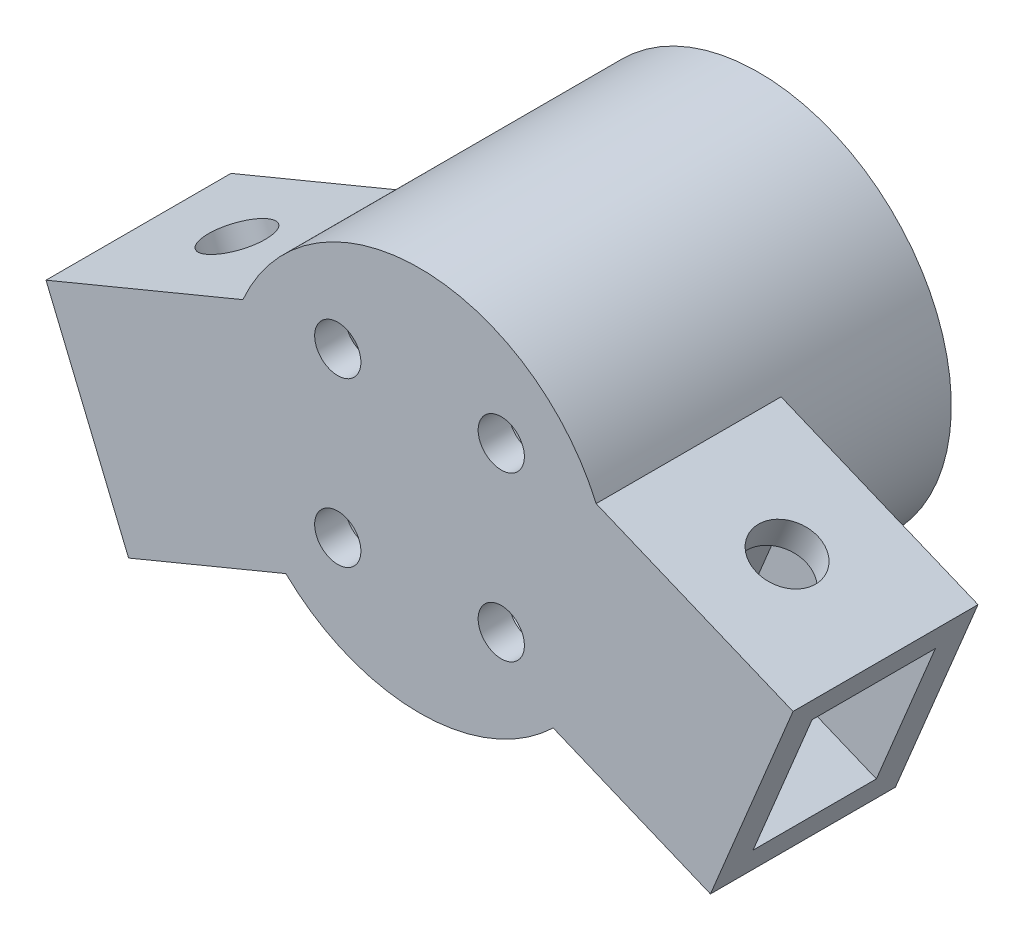
ISO-10303-21;
HEADER;
FILE_DESCRIPTION(('STEP AP214'),'2;1');
FILE_NAME('part.step','',(''),(''),'','','');
FILE_SCHEMA(('AUTOMOTIVE_DESIGN { 1 0 10303 214 1 1 1 1 }'));
ENDSEC;
DATA;
#1=APPLICATION_CONTEXT('core data for automotive mechanical design processes');
#2=APPLICATION_PROTOCOL_DEFINITION('international standard','automotive_design',2000,#1);
#3=PRODUCT_CONTEXT('',#1,'mechanical');
#4=PRODUCT('Part','Part','',(#3));
#5=PRODUCT_RELATED_PRODUCT_CATEGORY('part','',(#4));
#6=PRODUCT_DEFINITION_FORMATION('','',#4);
#7=PRODUCT_DEFINITION_CONTEXT('part definition',#1,'design');
#8=PRODUCT_DEFINITION('design','',#6,#7);
#9=PRODUCT_DEFINITION_SHAPE('','',#8);
#10=(LENGTH_UNIT() NAMED_UNIT(*) SI_UNIT(.MILLI.,.METRE.));
#11=(NAMED_UNIT(*) PLANE_ANGLE_UNIT() SI_UNIT($,.RADIAN.));
#12=(NAMED_UNIT(*) SI_UNIT($,.STERADIAN.) SOLID_ANGLE_UNIT());
#13=UNCERTAINTY_MEASURE_WITH_UNIT(LENGTH_MEASURE(1.E-05),#10,'distance_accuracy_value','');
#14=(GEOMETRIC_REPRESENTATION_CONTEXT(3) GLOBAL_UNCERTAINTY_ASSIGNED_CONTEXT((#13)) GLOBAL_UNIT_ASSIGNED_CONTEXT((#10,
#11,#12)) REPRESENTATION_CONTEXT('',''));
#15=CARTESIAN_POINT('',(0.,0.,0.));
#16=DIRECTION('',(0.,0.,1.));
#17=DIRECTION('',(1.,0.,0.));
#18=AXIS2_PLACEMENT_3D('',#15,#16,#17);
#19=CARTESIAN_POINT('',(0.,0.,0.));
#20=DIRECTION('',(0.,0.,1.));
#21=DIRECTION('',(1.,0.,0.));
#22=AXIS2_PLACEMENT_3D('',#19,#20,#21);
#23=PLANE('',#22);
#24=CARTESIAN_POINT('',(0.,0.,0.));
#25=DIRECTION('',(0.,0.,-1.));
#26=DIRECTION('',(-1.,0.,0.));
#27=AXIS2_PLACEMENT_3D('',#24,#25,#26);
#28=CIRCLE('',#27,12.5);
#29=CARTESIAN_POINT('',(11.458506301557,4.99526108798904,0.));
#30=VERTEX_POINT('',#29);
#31=CARTESIAN_POINT('',(8.67095256505801,-9.00358715260279,0.));
#32=VERTEX_POINT('',#31);
#33=EDGE_CURVE('E11',#30,#32,#28,.T.);
#34=ORIENTED_EDGE('',*,*,#33,.F.);
#35=DIRECTION('',(-0.923879532511286,0.382683432365091,0.));
#36=VECTOR('',#35,1.);
#37=CARTESIAN_POINT('',(24.2314403727898,-0.295461435612961,0.));
#38=LINE('',#37,#36);
#39=CARTESIAN_POINT('',(24.2314403727898,-0.295461435612961,0.));
#40=VERTEX_POINT('',#39);
#41=EDGE_CURVE('E282',#40,#30,#38,.T.);
#42=ORIENTED_EDGE('',*,*,#41,.F.);
#43=DIRECTION('',(0.382683432365091,0.923879532511286,0.));
#44=VECTOR('',#43,1.);
#45=CARTESIAN_POINT('',(20.7872894815039,-8.61037722821454,0.));
#46=LINE('',#45,#44);
#47=CARTESIAN_POINT('',(18.8738723196785,-13.229774890771,0.));
#48=VERTEX_POINT('',#47);
#49=EDGE_CURVE('E271',#48,#40,#46,.T.);
#50=ORIENTED_EDGE('',*,*,#49,.F.);
#51=DIRECTION('',(0.923879532511287,-0.382683432365091,0.));
#52=VECTOR('',#51,1.);
#53=CARTESIAN_POINT('',(18.8738723196785,-13.229774890771,0.));
#54=LINE('',#53,#52);
#55=EDGE_CURVE('E275',#32,#48,#54,.T.);
#56=ORIENTED_EDGE('',*,*,#55,.F.);
#57=EDGE_LOOP('',(#34,#42,#50,#56));
#58=FACE_BOUND('',#57,.T.);
#59=ADVANCED_FACE('F35',(#58),#23,.F.);
#60=CARTESIAN_POINT('',(-20.7872894815039,-8.61037722821454,12.));
#61=DIRECTION('',(0.923879532511287,0.382683432365091,0.));
#62=DIRECTION('',(-0.382683432365091,0.923879532511287,0.));
#63=AXIS2_PLACEMENT_3D('',#60,#61,#62);
#64=PLANE('',#63);
#65=DIRECTION('',(0.38268343236509,-0.923879532511286,0.));
#66=VECTOR('',#65,1.);
#67=CARTESIAN_POINT('',(-20.7872894815039,-8.61037722821454,0.));
#68=LINE('',#67,#66);
#69=CARTESIAN_POINT('',(-24.2314403727898,-0.295461435612961,0.));
#70=VERTEX_POINT('',#69);
#71=CARTESIAN_POINT('',(-18.8738723196785,-13.229774890771,0.));
#72=VERTEX_POINT('',#71);
#73=EDGE_CURVE('E157',#70,#72,#68,.T.);
#74=ORIENTED_EDGE('',*,*,#73,.T.);
#75=DIRECTION('',(0.,0.,-1.));
#76=VECTOR('',#75,1.);
#77=CARTESIAN_POINT('',(-18.8738723196785,-13.229774890771,12.));
#78=LINE('',#77,#76);
#79=CARTESIAN_POINT('',(-18.8738723196785,-13.229774890771,12.));
#80=VERTEX_POINT('',#79);
#81=EDGE_CURVE('E268',#80,#72,#78,.T.);
#82=ORIENTED_EDGE('',*,*,#81,.F.);
#83=DIRECTION('',(0.382683432365091,-0.923879532511286,0.));
#84=VECTOR('',#83,1.);
#85=CARTESIAN_POINT('',(-20.7872894815039,-8.61037722821454,12.));
#86=LINE('',#85,#84);
#87=CARTESIAN_POINT('',(-24.2314403727898,-0.295461435612961,12.));
#88=VERTEX_POINT('',#87);
#89=EDGE_CURVE('E161',#88,#80,#86,.T.);
#90=ORIENTED_EDGE('',*,*,#89,.F.);
#91=DIRECTION('',(0.,0.,-1.));
#92=VECTOR('',#91,1.);
#93=CARTESIAN_POINT('',(-24.2314403727898,-0.295461435612961,12.));
#94=LINE('',#93,#92);
#95=EDGE_CURVE('E171',#88,#70,#94,.T.);
#96=ORIENTED_EDGE('',*,*,#95,.T.);
#97=EDGE_LOOP('',(#74,#82,#90,#96));
#98=FACE_BOUND('',#97,.T.);
#99=DIRECTION('',(0.382683432365091,-0.923879532511286,0.));
#100=VECTOR('',#99,1.);
#101=CARTESIAN_POINT('',(-23.4660735080596,-2.14322050063553,10.));
#102=LINE('',#101,#100);
#103=CARTESIAN_POINT('',(-23.4660735080596,-2.14322050063554,10.));
#104=VERTEX_POINT('',#103);
#105=CARTESIAN_POINT('',(-19.6392391844087,-11.3820158257484,10.));
#106=VERTEX_POINT('',#105);
#107=EDGE_CURVE('E52',#104,#106,#102,.T.);
#108=ORIENTED_EDGE('',*,*,#107,.T.);
#109=DIRECTION('',(0.,0.,-1.));
#110=VECTOR('',#109,1.);
#111=CARTESIAN_POINT('',(-19.6392391844087,-11.3820158257484,10.));
#112=LINE('',#111,#110);
#113=CARTESIAN_POINT('',(-19.6392391844087,-11.3820158257484,2.));
#114=VERTEX_POINT('',#113);
#115=EDGE_CURVE('E196',#106,#114,#112,.T.);
#116=ORIENTED_EDGE('',*,*,#115,.T.);
#117=DIRECTION('',(-0.382683432365091,0.923879532511286,0.));
#118=VECTOR('',#117,1.);
#119=CARTESIAN_POINT('',(-23.4660735080596,-2.14322050063554,2.));
#120=LINE('',#119,#118);
#121=CARTESIAN_POINT('',(-23.4660735080596,-2.14322050063554,2.));
#122=VERTEX_POINT('',#121);
#123=EDGE_CURVE('E207',#114,#122,#120,.T.);
#124=ORIENTED_EDGE('',*,*,#123,.T.);
#125=DIRECTION('',(0.,0.,1.));
#126=VECTOR('',#125,1.);
#127=CARTESIAN_POINT('',(-23.4660735080596,-2.14322050063553,10.));
#128=LINE('',#127,#126);
#129=EDGE_CURVE('E204',#122,#104,#128,.T.);
#130=ORIENTED_EDGE('',*,*,#129,.T.);
#131=EDGE_LOOP('',(#108,#116,#124,#130));
#132=FACE_BOUND('',#131,.T.);
#133=ADVANCED_FACE('F345',(#98,#132),#64,.F.);
#134=CARTESIAN_POINT('',(0.,0.,12.));
#135=DIRECTION('',(0.,0.,-1.));
#136=DIRECTION('',(-1.,0.,0.));
#137=AXIS2_PLACEMENT_3D('',#134,#135,#136);
#138=CYLINDRICAL_SURFACE('',#137,12.5);
#139=DIRECTION('',(0.,0.,-1.));
#140=VECTOR('',#139,1.);
#141=CARTESIAN_POINT('',(-11.458506301557,4.99526108798904,12.));
#142=LINE('',#141,#140);
#143=CARTESIAN_POINT('',(-11.458506301557,4.99526108798904,12.));
#144=VERTEX_POINT('',#143);
#145=CARTESIAN_POINT('',(-11.4585063015571,4.99526108798904,0.));
#146=VERTEX_POINT('',#145);
#147=EDGE_CURVE('E165',#144,#146,#142,.T.);
#148=ORIENTED_EDGE('',*,*,#147,.F.);
#149=CARTESIAN_POINT('',(0.,0.,12.));
#150=DIRECTION('',(0.,0.,1.));
#151=DIRECTION('',(1.,0.,0.));
#152=AXIS2_PLACEMENT_3D('',#149,#150,#151);
#153=CIRCLE('',#152,12.5);
#154=CARTESIAN_POINT('',(11.458506301557,4.99526108798904,12.));
#155=VERTEX_POINT('',#154);
#156=EDGE_CURVE('E176',#155,#144,#153,.T.);
#157=ORIENTED_EDGE('',*,*,#156,.F.);
#158=DIRECTION('',(0.,0.,-1.));
#159=VECTOR('',#158,1.);
#160=CARTESIAN_POINT('',(11.458506301557,4.99526108798904,12.));
#161=LINE('',#160,#159);
#162=EDGE_CURVE('E291',#155,#30,#161,.T.);
#163=ORIENTED_EDGE('',*,*,#162,.T.);
#164=ORIENTED_EDGE('',*,*,#33,.T.);
#165=DIRECTION('',(0.,0.,-1.));
#166=VECTOR('',#165,1.);
#167=CARTESIAN_POINT('',(8.67095256505801,-9.00358715260279,12.));
#168=LINE('',#167,#166);
#169=CARTESIAN_POINT('',(8.67095256505801,-9.00358715260279,12.));
#170=VERTEX_POINT('',#169);
#171=EDGE_CURVE('E289',#170,#32,#168,.T.);
#172=ORIENTED_EDGE('',*,*,#171,.F.);
#173=CARTESIAN_POINT('',(-8.67095256505801,-9.00358715260278,12.));
#174=VERTEX_POINT('',#173);
#175=EDGE_CURVE('E177',#174,#170,#153,.T.);
#176=ORIENTED_EDGE('',*,*,#175,.F.);
#177=DIRECTION('',(0.,0.,-1.));
#178=VECTOR('',#177,1.);
#179=CARTESIAN_POINT('',(-8.67095256505801,-9.00358715260278,12.));
#180=LINE('',#179,#178);
#181=CARTESIAN_POINT('',(-8.67095256505801,-9.00358715260278,0.));
#182=VERTEX_POINT('',#181);
#183=EDGE_CURVE('E170',#174,#182,#180,.T.);
#184=ORIENTED_EDGE('',*,*,#183,.T.);
#185=EDGE_CURVE('E44',#182,#146,#28,.T.);
#186=ORIENTED_EDGE('',*,*,#185,.T.);
#187=EDGE_LOOP('',(#148,#157,#163,#164,#172,#176,#184,#186));
#188=FACE_BOUND('',#187,.T.);
#189=CARTESIAN_POINT('',(0.,0.,-10.));
#190=DIRECTION('',(0.,0.,-1.));
#191=DIRECTION('',(-1.,0.,0.));
#192=AXIS2_PLACEMENT_3D('',#189,#190,#191);
#193=CIRCLE('',#192,12.5);
#194=CARTESIAN_POINT('',(-12.5,0.,-10.));
#195=VERTEX_POINT('',#194);
#196=EDGE_CURVE('E181',#195,#195,#193,.T.);
#197=ORIENTED_EDGE('',*,*,#196,.F.);
#198=EDGE_LOOP('',(#197));
#199=FACE_BOUND('',#198,.T.);
#200=ADVANCED_FACE('F37',(#188,#199),#138,.T.);
#201=CARTESIAN_POINT('',(0.,0.,12.));
#202=DIRECTION('',(0.,0.,1.));
#203=DIRECTION('',(1.,0.,0.));
#204=AXIS2_PLACEMENT_3D('',#201,#202,#203);
#205=PLANE('',#204);
#206=CARTESIAN_POINT('',(5.30330085889911,-5.30330085889911,12.));
#207=DIRECTION('',(0.,0.,1.));
#208=DIRECTION('',(-1.,0.,0.));
#209=AXIS2_PLACEMENT_3D('',#206,#207,#208);
#210=CIRCLE('',#209,1.5);
#211=CARTESIAN_POINT('',(3.80330085889911,-5.30330085889911,12.));
#212=VERTEX_POINT('',#211);
#213=EDGE_CURVE('E297',#212,#212,#210,.T.);
#214=ORIENTED_EDGE('',*,*,#213,.F.);
#215=EDGE_LOOP('',(#214));
#216=FACE_BOUND('',#215,.T.);
#217=CARTESIAN_POINT('',(-5.30330085889911,-5.30330085889911,12.));
#218=DIRECTION('',(0.,0.,1.));
#219=DIRECTION('',(1.,0.,0.));
#220=AXIS2_PLACEMENT_3D('',#217,#218,#219);
#221=CIRCLE('',#220,1.5);
#222=CARTESIAN_POINT('',(-3.80330085889911,-5.30330085889911,12.));
#223=VERTEX_POINT('',#222);
#224=EDGE_CURVE('E306',#223,#223,#221,.T.);
#225=ORIENTED_EDGE('',*,*,#224,.F.);
#226=EDGE_LOOP('',(#225));
#227=FACE_BOUND('',#226,.T.);
#228=CARTESIAN_POINT('',(-5.30330085889911,5.30330085889911,12.));
#229=DIRECTION('',(0.,0.,1.));
#230=DIRECTION('',(-1.,0.,0.));
#231=AXIS2_PLACEMENT_3D('',#228,#229,#230);
#232=CIRCLE('',#231,1.5);
#233=CARTESIAN_POINT('',(-6.80330085889911,5.30330085889911,12.));
#234=VERTEX_POINT('',#233);
#235=EDGE_CURVE('E298',#234,#234,#232,.T.);
#236=ORIENTED_EDGE('',*,*,#235,.F.);
#237=EDGE_LOOP('',(#236));
#238=FACE_BOUND('',#237,.T.);
#239=CARTESIAN_POINT('',(5.30330085889911,5.30330085889911,12.));
#240=DIRECTION('',(0.,0.,1.));
#241=DIRECTION('',(1.,0.,0.));
#242=AXIS2_PLACEMENT_3D('',#239,#240,#241);
#243=CIRCLE('',#242,1.5);
#244=CARTESIAN_POINT('',(6.80330085889911,5.30330085889911,12.));
#245=VERTEX_POINT('',#244);
#246=EDGE_CURVE('E305',#245,#245,#243,.T.);
#247=ORIENTED_EDGE('',*,*,#246,.F.);
#248=EDGE_LOOP('',(#247));
#249=FACE_BOUND('',#248,.T.);
#250=ORIENTED_EDGE('',*,*,#156,.T.);
#251=DIRECTION('',(-0.923879532511286,-0.382683432365091,0.));
#252=VECTOR('',#251,1.);
#253=CARTESIAN_POINT('',(-24.2314403727898,-0.295461435612961,12.));
#254=LINE('',#253,#252);
#255=EDGE_CURVE('E167',#144,#88,#254,.T.);
#256=ORIENTED_EDGE('',*,*,#255,.T.);
#257=ORIENTED_EDGE('',*,*,#89,.T.);
#258=DIRECTION('',(0.923879532511287,0.382683432365091,0.));
#259=VECTOR('',#258,1.);
#260=CARTESIAN_POINT('',(-18.8738723196785,-13.229774890771,12.));
#261=LINE('',#260,#259);
#262=EDGE_CURVE('E260',#80,#174,#261,.T.);
#263=ORIENTED_EDGE('',*,*,#262,.T.);
#264=ORIENTED_EDGE('',*,*,#175,.T.);
#265=DIRECTION('',(0.923879532511287,-0.382683432365091,0.));
#266=VECTOR('',#265,1.);
#267=CARTESIAN_POINT('',(18.8738723196785,-13.229774890771,12.));
#268=LINE('',#267,#266);
#269=CARTESIAN_POINT('',(18.8738723196785,-13.229774890771,12.));
#270=VERTEX_POINT('',#269);
#271=EDGE_CURVE('E278',#170,#270,#268,.T.);
#272=ORIENTED_EDGE('',*,*,#271,.T.);
#273=DIRECTION('',(0.38268343236509,0.923879532511286,0.));
#274=VECTOR('',#273,1.);
#275=CARTESIAN_POINT('',(20.7872894815039,-8.61037722821454,12.));
#276=LINE('',#275,#274);
#277=CARTESIAN_POINT('',(24.2314403727898,-0.295461435612961,12.));
#278=VERTEX_POINT('',#277);
#279=EDGE_CURVE('E272',#270,#278,#276,.T.);
#280=ORIENTED_EDGE('',*,*,#279,.T.);
#281=DIRECTION('',(-0.923879532511286,0.382683432365091,0.));
#282=VECTOR('',#281,1.);
#283=CARTESIAN_POINT('',(24.2314403727898,-0.295461435612961,12.));
#284=LINE('',#283,#282);
#285=EDGE_CURVE('E274',#278,#155,#284,.T.);
#286=ORIENTED_EDGE('',*,*,#285,.T.);
#287=EDGE_LOOP('',(#250,#256,#257,#263,#264,#272,#280,#286));
#288=FACE_BOUND('',#287,.T.);
#289=ADVANCED_FACE('F355',(#216,#227,#238,#249,#288),#205,.T.);
#290=ORIENTED_EDGE('',*,*,#185,.F.);
#291=DIRECTION('',(0.923879532511287,0.382683432365091,0.));
#292=VECTOR('',#291,1.);
#293=CARTESIAN_POINT('',(-18.8738723196785,-13.229774890771,0.));
#294=LINE('',#293,#292);
#295=EDGE_CURVE('E162',#72,#182,#294,.T.);
#296=ORIENTED_EDGE('',*,*,#295,.F.);
#297=ORIENTED_EDGE('',*,*,#73,.F.);
#298=DIRECTION('',(-0.923879532511286,-0.382683432365091,0.));
#299=VECTOR('',#298,1.);
#300=CARTESIAN_POINT('',(-24.2314403727898,-0.295461435612961,0.));
#301=LINE('',#300,#299);
#302=EDGE_CURVE('E151',#146,#70,#301,.T.);
#303=ORIENTED_EDGE('',*,*,#302,.F.);
#304=EDGE_LOOP('',(#290,#296,#297,#303));
#305=FACE_BOUND('',#304,.T.);
#306=ADVANCED_FACE('F153',(#305),#23,.F.);
#307=CARTESIAN_POINT('',(0.,0.,10.));
#308=DIRECTION('',(0.,0.,-1.));
#309=DIRECTION('',(-1.,0.,0.));
#310=AXIS2_PLACEMENT_3D('',#307,#308,#309);
#311=CYLINDRICAL_SURFACE('',#310,11.25);
#312=CARTESIAN_POINT('',(0.,0.,10.));
#313=DIRECTION('',(0.,0.,1.));
#314=DIRECTION('',(1.,0.,0.));
#315=AXIS2_PLACEMENT_3D('',#312,#313,#314);
#316=CIRCLE('',#315,11.25);
#317=CARTESIAN_POINT('',(11.25,0.,10.));
#318=VERTEX_POINT('',#317);
#319=EDGE_CURVE('E321',#318,#318,#316,.T.);
#320=ORIENTED_EDGE('',*,*,#319,.T.);
#321=EDGE_LOOP('',(#320));
#322=FACE_BOUND('',#321,.T.);
#323=CARTESIAN_POINT('',(0.,0.,-10.));
#324=DIRECTION('',(0.,0.,-1.));
#325=DIRECTION('',(-1.,0.,0.));
#326=AXIS2_PLACEMENT_3D('',#323,#324,#325);
#327=CIRCLE('',#326,11.25);
#328=CARTESIAN_POINT('',(-11.25,0.,-10.));
#329=VERTEX_POINT('',#328);
#330=EDGE_CURVE('E589',#329,#329,#327,.T.);
#331=ORIENTED_EDGE('',*,*,#330,.T.);
#332=EDGE_LOOP('',(#331));
#333=FACE_BOUND('',#332,.T.);
#334=ADVANCED_FACE('F354',(#322,#333),#311,.F.);
#335=CARTESIAN_POINT('',(0.,0.,10.));
#336=DIRECTION('',(0.,0.,1.));
#337=DIRECTION('',(1.,0.,0.));
#338=AXIS2_PLACEMENT_3D('',#335,#336,#337);
#339=PLANE('',#338);
#340=CARTESIAN_POINT('',(5.30330085889911,-5.30330085889911,10.));
#341=DIRECTION('',(0.,0.,1.));
#342=DIRECTION('',(1.,0.,0.));
#343=AXIS2_PLACEMENT_3D('',#340,#341,#342);
#344=CIRCLE('',#343,1.5);
#345=CARTESIAN_POINT('',(6.80330085889911,-5.30330085889911,10.));
#346=VERTEX_POINT('',#345);
#347=EDGE_CURVE('E309',#346,#346,#344,.F.);
#348=ORIENTED_EDGE('',*,*,#347,.F.);
#349=EDGE_LOOP('',(#348));
#350=FACE_BOUND('',#349,.T.);
#351=CARTESIAN_POINT('',(-5.30330085889911,-5.30330085889911,10.));
#352=DIRECTION('',(0.,0.,1.));
#353=DIRECTION('',(1.,0.,0.));
#354=AXIS2_PLACEMENT_3D('',#351,#352,#353);
#355=CIRCLE('',#354,1.5);
#356=CARTESIAN_POINT('',(-3.80330085889911,-5.30330085889911,10.));
#357=VERTEX_POINT('',#356);
#358=EDGE_CURVE('E302',#357,#357,#355,.F.);
#359=ORIENTED_EDGE('',*,*,#358,.F.);
#360=EDGE_LOOP('',(#359));
#361=FACE_BOUND('',#360,.T.);
#362=CARTESIAN_POINT('',(-5.30330085889911,5.30330085889911,10.));
#363=DIRECTION('',(0.,0.,1.));
#364=DIRECTION('',(1.,0.,0.));
#365=AXIS2_PLACEMENT_3D('',#362,#363,#364);
#366=CIRCLE('',#365,1.5);
#367=CARTESIAN_POINT('',(-3.80330085889911,5.30330085889911,10.));
#368=VERTEX_POINT('',#367);
#369=EDGE_CURVE('E301',#368,#368,#366,.F.);
#370=ORIENTED_EDGE('',*,*,#369,.F.);
#371=EDGE_LOOP('',(#370));
#372=FACE_BOUND('',#371,.T.);
#373=CARTESIAN_POINT('',(5.30330085889911,5.30330085889911,10.));
#374=DIRECTION('',(0.,0.,1.));
#375=DIRECTION('',(1.,0.,0.));
#376=AXIS2_PLACEMENT_3D('',#373,#374,#375);
#377=CIRCLE('',#376,1.5);
#378=CARTESIAN_POINT('',(6.80330085889911,5.30330085889911,10.));
#379=VERTEX_POINT('',#378);
#380=EDGE_CURVE('E318',#379,#379,#377,.F.);
#381=ORIENTED_EDGE('',*,*,#380,.F.);
#382=EDGE_LOOP('',(#381));
#383=FACE_BOUND('',#382,.T.);
#384=ORIENTED_EDGE('',*,*,#319,.F.);
#385=EDGE_LOOP('',(#384));
#386=FACE_BOUND('',#385,.T.);
#387=ADVANCED_FACE('F360',(#350,#361,#372,#383,#386),#339,.F.);
#388=CARTESIAN_POINT('',(5.30330085889911,5.30330085889911,-0.000999999999999265));
#389=DIRECTION('',(0.,0.,1.));
#390=DIRECTION('',(1.,0.,0.));
#391=AXIS2_PLACEMENT_3D('',#388,#389,#390);
#392=CYLINDRICAL_SURFACE('',#391,1.5);
#393=ORIENTED_EDGE('',*,*,#246,.T.);
#394=EDGE_LOOP('',(#393));
#395=FACE_BOUND('',#394,.T.);
#396=ORIENTED_EDGE('',*,*,#380,.T.);
#397=EDGE_LOOP('',(#396));
#398=FACE_BOUND('',#397,.T.);
#399=ADVANCED_FACE('F372',(#395,#398),#392,.F.);
#400=CARTESIAN_POINT('',(-5.30330085889911,5.30330085889911,-0.000999999999999265));
#401=DIRECTION('',(0.,0.,1.));
#402=DIRECTION('',(1.,0.,0.));
#403=AXIS2_PLACEMENT_3D('',#400,#401,#402);
#404=CYLINDRICAL_SURFACE('',#403,1.5);
#405=ORIENTED_EDGE('',*,*,#235,.T.);
#406=EDGE_LOOP('',(#405));
#407=FACE_BOUND('',#406,.T.);
#408=ORIENTED_EDGE('',*,*,#369,.T.);
#409=EDGE_LOOP('',(#408));
#410=FACE_BOUND('',#409,.T.);
#411=ADVANCED_FACE('F376',(#407,#410),#404,.F.);
#412=CARTESIAN_POINT('',(-5.30330085889911,-5.30330085889911,-0.000999999999999265));
#413=DIRECTION('',(0.,0.,1.));
#414=DIRECTION('',(1.,0.,0.));
#415=AXIS2_PLACEMENT_3D('',#412,#413,#414);
#416=CYLINDRICAL_SURFACE('',#415,1.5);
#417=ORIENTED_EDGE('',*,*,#224,.T.);
#418=EDGE_LOOP('',(#417));
#419=FACE_BOUND('',#418,.T.);
#420=ORIENTED_EDGE('',*,*,#358,.T.);
#421=EDGE_LOOP('',(#420));
#422=FACE_BOUND('',#421,.T.);
#423=ADVANCED_FACE('F382',(#419,#422),#416,.F.);
#424=CARTESIAN_POINT('',(5.30330085889911,-5.30330085889911,-0.000999999999999265));
#425=DIRECTION('',(0.,0.,1.));
#426=DIRECTION('',(1.,0.,0.));
#427=AXIS2_PLACEMENT_3D('',#424,#425,#426);
#428=CYLINDRICAL_SURFACE('',#427,1.5);
#429=ORIENTED_EDGE('',*,*,#213,.T.);
#430=EDGE_LOOP('',(#429));
#431=FACE_BOUND('',#430,.T.);
#432=ORIENTED_EDGE('',*,*,#347,.T.);
#433=EDGE_LOOP('',(#432));
#434=FACE_BOUND('',#433,.T.);
#435=ADVANCED_FACE('F378',(#431,#434),#428,.F.);
#436=CARTESIAN_POINT('',(20.7872894815039,-8.61037722821454,12.));
#437=DIRECTION('',(-0.923879532511286,0.382683432365091,0.));
#438=DIRECTION('',(-0.382683432365091,-0.923879532511287,0.));
#439=AXIS2_PLACEMENT_3D('',#436,#437,#438);
#440=PLANE('',#439);
#441=DIRECTION('',(0.,0.,-1.));
#442=VECTOR('',#441,1.);
#443=CARTESIAN_POINT('',(19.6392391844087,-11.3820158257484,10.));
#444=LINE('',#443,#442);
#445=CARTESIAN_POINT('',(19.6392391844087,-11.3820158257484,10.));
#446=VERTEX_POINT('',#445);
#447=CARTESIAN_POINT('',(19.6392391844087,-11.3820158257484,2.));
#448=VERTEX_POINT('',#447);
#449=EDGE_CURVE('E244',#446,#448,#444,.T.);
#450=ORIENTED_EDGE('',*,*,#449,.F.);
#451=DIRECTION('',(-0.382683432365091,-0.923879532511286,0.));
#452=VECTOR('',#451,1.);
#453=CARTESIAN_POINT('',(23.4660735080596,-2.14322050063553,10.));
#454=LINE('',#453,#452);
#455=CARTESIAN_POINT('',(23.4660735080596,-2.14322050063553,10.));
#456=VERTEX_POINT('',#455);
#457=EDGE_CURVE('E60',#456,#446,#454,.T.);
#458=ORIENTED_EDGE('',*,*,#457,.F.);
#459=DIRECTION('',(0.,0.,1.));
#460=VECTOR('',#459,1.);
#461=CARTESIAN_POINT('',(23.4660735080596,-2.14322050063553,10.));
#462=LINE('',#461,#460);
#463=CARTESIAN_POINT('',(23.4660735080596,-2.14322050063554,2.));
#464=VERTEX_POINT('',#463);
#465=EDGE_CURVE('E233',#464,#456,#462,.T.);
#466=ORIENTED_EDGE('',*,*,#465,.F.);
#467=DIRECTION('',(0.382683432365091,0.923879532511286,0.));
#468=VECTOR('',#467,1.);
#469=CARTESIAN_POINT('',(23.4660735080596,-2.14322050063554,2.));
#470=LINE('',#469,#468);
#471=EDGE_CURVE('E247',#448,#464,#470,.T.);
#472=ORIENTED_EDGE('',*,*,#471,.F.);
#473=EDGE_LOOP('',(#450,#458,#466,#472));
#474=FACE_BOUND('',#473,.T.);
#475=ORIENTED_EDGE('',*,*,#49,.T.);
#476=DIRECTION('',(0.,0.,-1.));
#477=VECTOR('',#476,1.);
#478=CARTESIAN_POINT('',(24.2314403727898,-0.295461435612961,12.));
#479=LINE('',#478,#477);
#480=EDGE_CURVE('E294',#278,#40,#479,.T.);
#481=ORIENTED_EDGE('',*,*,#480,.F.);
#482=ORIENTED_EDGE('',*,*,#279,.F.);
#483=DIRECTION('',(0.,0.,-1.));
#484=VECTOR('',#483,1.);
#485=CARTESIAN_POINT('',(18.8738723196785,-13.229774890771,12.));
#486=LINE('',#485,#484);
#487=EDGE_CURVE('E280',#270,#48,#486,.T.);
#488=ORIENTED_EDGE('',*,*,#487,.T.);
#489=EDGE_LOOP('',(#475,#481,#482,#488));
#490=FACE_BOUND('',#489,.T.);
#491=ADVANCED_FACE('F381',(#474,#490),#440,.F.);
#492=CARTESIAN_POINT('',(24.2314403727898,-0.295461435612961,12.));
#493=DIRECTION('',(-0.382683432365091,-0.923879532511286,0.));
#494=DIRECTION('',(0.923879532511286,-0.382683432365091,0.));
#495=AXIS2_PLACEMENT_3D('',#492,#493,#494);
#496=PLANE('',#495);
#497=CARTESIAN_POINT('',(17.8449733371734,2.34989982618804,6.));
#498=DIRECTION('',(0.382683432365091,0.923879532511286,0.));
#499=DIRECTION('',(-0.923879532511286,0.382683432365091,0.));
#500=AXIS2_PLACEMENT_3D('',#497,#498,#499);
#501=CIRCLE('',#500,2.);
#502=CARTESIAN_POINT('',(15.9972142721508,3.11526669091822,6.));
#503=VERTEX_POINT('',#502);
#504=EDGE_CURVE('E214',#503,#503,#501,.T.);
#505=ORIENTED_EDGE('',*,*,#504,.F.);
#506=EDGE_LOOP('',(#505));
#507=FACE_BOUND('',#506,.T.);
#508=ORIENTED_EDGE('',*,*,#41,.T.);
#509=ORIENTED_EDGE('',*,*,#162,.F.);
#510=ORIENTED_EDGE('',*,*,#285,.F.);
#511=ORIENTED_EDGE('',*,*,#480,.T.);
#512=EDGE_LOOP('',(#508,#509,#510,#511));
#513=FACE_BOUND('',#512,.T.);
#514=ADVANCED_FACE('F392',(#507,#513),#496,.F.);
#515=CARTESIAN_POINT('',(18.8738723196785,-13.229774890771,12.));
#516=DIRECTION('',(0.382683432365091,0.923879532511286,0.));
#517=DIRECTION('',(-0.923879532511287,0.382683432365091,0.));
#518=AXIS2_PLACEMENT_3D('',#515,#516,#517);
#519=PLANE('',#518);
#520=CARTESIAN_POINT('',(12.4874052840621,-10.58441362897,6.));
#521=DIRECTION('',(0.382683432365091,0.923879532511286,0.));
#522=DIRECTION('',(-0.923879532511287,0.382683432365091,0.));
#523=AXIS2_PLACEMENT_3D('',#520,#521,#522);
#524=CIRCLE('',#523,2.);
#525=CARTESIAN_POINT('',(10.6396462190396,-9.81904676423979,6.));
#526=VERTEX_POINT('',#525);
#527=EDGE_CURVE('E222',#526,#526,#524,.F.);
#528=ORIENTED_EDGE('',*,*,#527,.F.);
#529=EDGE_LOOP('',(#528));
#530=FACE_BOUND('',#529,.T.);
#531=ORIENTED_EDGE('',*,*,#55,.T.);
#532=ORIENTED_EDGE('',*,*,#487,.F.);
#533=ORIENTED_EDGE('',*,*,#271,.F.);
#534=ORIENTED_EDGE('',*,*,#171,.T.);
#535=EDGE_LOOP('',(#531,#532,#533,#534));
#536=FACE_BOUND('',#535,.T.);
#537=ADVANCED_FACE('F396',(#530,#536),#519,.F.);
#538=CARTESIAN_POINT('',(-18.8738723196785,-13.229774890771,12.));
#539=DIRECTION('',(-0.382683432365091,0.923879532511286,0.));
#540=DIRECTION('',(-0.923879532511287,-0.382683432365091,0.));
#541=AXIS2_PLACEMENT_3D('',#538,#539,#540);
#542=PLANE('',#541);
#543=CARTESIAN_POINT('',(-12.4874052840621,-10.58441362897,6.));
#544=DIRECTION('',(-0.382683432365091,0.923879532511286,0.));
#545=DIRECTION('',(-0.923879532511287,-0.382683432365091,0.));
#546=AXIS2_PLACEMENT_3D('',#543,#544,#545);
#547=CIRCLE('',#546,2.);
#548=CARTESIAN_POINT('',(-14.3351643490847,-11.3497804937002,6.));
#549=VERTEX_POINT('',#548);
#550=EDGE_CURVE('E186',#549,#549,#547,.F.);
#551=ORIENTED_EDGE('',*,*,#550,.F.);
#552=EDGE_LOOP('',(#551));
#553=FACE_BOUND('',#552,.T.);
#554=ORIENTED_EDGE('',*,*,#295,.T.);
#555=ORIENTED_EDGE('',*,*,#183,.F.);
#556=ORIENTED_EDGE('',*,*,#262,.F.);
#557=ORIENTED_EDGE('',*,*,#81,.T.);
#558=EDGE_LOOP('',(#554,#555,#556,#557));
#559=FACE_BOUND('',#558,.T.);
#560=ADVANCED_FACE('F399',(#553,#559),#542,.F.);
#561=CARTESIAN_POINT('',(-24.2314403727898,-0.295461435612961,12.));
#562=DIRECTION('',(0.382683432365091,-0.923879532511286,0.));
#563=DIRECTION('',(0.923879532511286,0.382683432365091,0.));
#564=AXIS2_PLACEMENT_3D('',#561,#562,#563);
#565=PLANE('',#564);
#566=CARTESIAN_POINT('',(-17.8449733371734,2.34989982618804,6.));
#567=DIRECTION('',(-0.382683432365091,0.923879532511286,0.));
#568=DIRECTION('',(-0.923879532511286,-0.382683432365091,0.));
#569=AXIS2_PLACEMENT_3D('',#566,#567,#568);
#570=CIRCLE('',#569,2.);
#571=CARTESIAN_POINT('',(-19.692732402196,1.58453296145786,6.));
#572=VERTEX_POINT('',#571);
#573=EDGE_CURVE('E183',#572,#572,#570,.T.);
#574=ORIENTED_EDGE('',*,*,#573,.F.);
#575=EDGE_LOOP('',(#574));
#576=FACE_BOUND('',#575,.T.);
#577=ORIENTED_EDGE('',*,*,#302,.T.);
#578=ORIENTED_EDGE('',*,*,#95,.F.);
#579=ORIENTED_EDGE('',*,*,#255,.F.);
#580=ORIENTED_EDGE('',*,*,#147,.T.);
#581=EDGE_LOOP('',(#577,#578,#579,#580));
#582=FACE_BOUND('',#581,.T.);
#583=ADVANCED_FACE('F166',(#576,#582),#565,.F.);
#584=CARTESIAN_POINT('',(14.2272781829467,1.68361382301537,10.));
#585=DIRECTION('',(0.,0.,1.));
#586=DIRECTION('',(0.,-1.,0.));
#587=AXIS2_PLACEMENT_3D('',#584,#585,#586);
#588=PLANE('',#587);
#589=ORIENTED_EDGE('',*,*,#457,.T.);
#590=DIRECTION('',(0.923879532511286,-0.382683432365091,0.));
#591=VECTOR('',#590,1.);
#592=CARTESIAN_POINT('',(10.4004438592958,-7.55518150209749,10.));
#593=LINE('',#592,#591);
#594=CARTESIAN_POINT('',(10.4004438592958,-7.55518150209749,10.));
#595=VERTEX_POINT('',#594);
#596=EDGE_CURVE('E242',#595,#446,#593,.T.);
#597=ORIENTED_EDGE('',*,*,#596,.F.);
#598=DIRECTION('',(-0.382683432365091,-0.923879532511286,0.));
#599=VECTOR('',#598,1.);
#600=CARTESIAN_POINT('',(14.2272781829467,1.68361382301537,10.));
#601=LINE('',#600,#599);
#602=CARTESIAN_POINT('',(14.2272781829467,1.68361382301537,10.));
#603=VERTEX_POINT('',#602);
#604=EDGE_CURVE('E229',#603,#595,#601,.T.);
#605=ORIENTED_EDGE('',*,*,#604,.F.);
#606=DIRECTION('',(0.923879532511286,-0.382683432365091,0.));
#607=VECTOR('',#606,1.);
#608=CARTESIAN_POINT('',(14.2272781829467,1.68361382301537,10.));
#609=LINE('',#608,#607);
#610=EDGE_CURVE('E252',#603,#456,#609,.T.);
#611=ORIENTED_EDGE('',*,*,#610,.T.);
#612=EDGE_LOOP('',(#589,#597,#605,#611));
#613=FACE_BOUND('',#612,.T.);
#614=ADVANCED_FACE('F407',(#613),#588,.F.);
#615=CARTESIAN_POINT('',(14.2272781829467,1.68361382301537,10.));
#616=DIRECTION('',(0.382683432365091,0.923879532511286,0.));
#617=DIRECTION('',(-0.923879532511286,0.382683432365091,0.));
#618=AXIS2_PLACEMENT_3D('',#615,#616,#617);
#619=PLANE('',#618);
#620=CARTESIAN_POINT('',(17.0796064724432,0.502140761165466,6.));
#621=DIRECTION('',(0.382683432365091,0.923879532511286,0.));
#622=DIRECTION('',(-0.923879532511286,0.382683432365091,0.));
#623=AXIS2_PLACEMENT_3D('',#620,#621,#622);
#624=CIRCLE('',#623,2.);
#625=CARTESIAN_POINT('',(15.2318474074207,1.26750762589565,6.));
#626=VERTEX_POINT('',#625);
#627=EDGE_CURVE('E226',#626,#626,#624,.T.);
#628=ORIENTED_EDGE('',*,*,#627,.T.);
#629=EDGE_LOOP('',(#628));
#630=FACE_BOUND('',#629,.T.);
#631=ORIENTED_EDGE('',*,*,#465,.T.);
#632=ORIENTED_EDGE('',*,*,#610,.F.);
#633=DIRECTION('',(0.,0.,1.));
#634=VECTOR('',#633,1.);
#635=CARTESIAN_POINT('',(14.2272781829467,1.68361382301537,10.));
#636=LINE('',#635,#634);
#637=CARTESIAN_POINT('',(14.2272781829467,1.68361382301537,2.));
#638=VERTEX_POINT('',#637);
#639=EDGE_CURVE('E239',#638,#603,#636,.T.);
#640=ORIENTED_EDGE('',*,*,#639,.F.);
#641=DIRECTION('',(0.923879532511286,-0.382683432365091,0.));
#642=VECTOR('',#641,1.);
#643=CARTESIAN_POINT('',(14.2272781829467,1.68361382301537,2.));
#644=LINE('',#643,#642);
#645=EDGE_CURVE('E254',#638,#464,#644,.T.);
#646=ORIENTED_EDGE('',*,*,#645,.T.);
#647=EDGE_LOOP('',(#631,#632,#640,#646));
#648=FACE_BOUND('',#647,.T.);
#649=ADVANCED_FACE('F411',(#630,#648),#619,.F.);
#650=CARTESIAN_POINT('',(14.2272781829467,1.68361382301537,2.));
#651=DIRECTION('',(0.,0.,-1.));
#652=DIRECTION('',(-1.,0.,0.));
#653=AXIS2_PLACEMENT_3D('',#650,#651,#652);
#654=PLANE('',#653);
#655=ORIENTED_EDGE('',*,*,#471,.T.);
#656=ORIENTED_EDGE('',*,*,#645,.F.);
#657=DIRECTION('',(0.382683432365091,0.923879532511286,0.));
#658=VECTOR('',#657,1.);
#659=CARTESIAN_POINT('',(14.2272781829467,1.68361382301537,2.));
#660=LINE('',#659,#658);
#661=CARTESIAN_POINT('',(10.4004438592958,-7.55518150209749,2.));
#662=VERTEX_POINT('',#661);
#663=EDGE_CURVE('E236',#662,#638,#660,.T.);
#664=ORIENTED_EDGE('',*,*,#663,.F.);
#665=DIRECTION('',(0.923879532511286,-0.382683432365091,0.));
#666=VECTOR('',#665,1.);
#667=CARTESIAN_POINT('',(10.4004438592958,-7.55518150209749,2.));
#668=LINE('',#667,#666);
#669=EDGE_CURVE('E256',#662,#448,#668,.T.);
#670=ORIENTED_EDGE('',*,*,#669,.T.);
#671=EDGE_LOOP('',(#655,#656,#664,#670));
#672=FACE_BOUND('',#671,.T.);
#673=ADVANCED_FACE('F414',(#672),#654,.F.);
#674=CARTESIAN_POINT('',(10.4004438592958,-7.55518150209749,10.));
#675=DIRECTION('',(-0.382683432365091,-0.923879532511286,0.));
#676=DIRECTION('',(0.923879532511286,-0.382683432365091,0.));
#677=AXIS2_PLACEMENT_3D('',#674,#675,#676);
#678=PLANE('',#677);
#679=CARTESIAN_POINT('',(13.2527721487923,-8.73665456394739,6.));
#680=DIRECTION('',(-0.382683432365091,-0.923879532511286,0.));
#681=DIRECTION('',(0.923879532511286,-0.382683432365091,0.));
#682=AXIS2_PLACEMENT_3D('',#679,#680,#681);
#683=CIRCLE('',#682,2.);
#684=CARTESIAN_POINT('',(15.1005312138149,-9.50202142867757,6.));
#685=VERTEX_POINT('',#684);
#686=EDGE_CURVE('E225',#685,#685,#683,.T.);
#687=ORIENTED_EDGE('',*,*,#686,.T.);
#688=EDGE_LOOP('',(#687));
#689=FACE_BOUND('',#688,.T.);
#690=ORIENTED_EDGE('',*,*,#449,.T.);
#691=ORIENTED_EDGE('',*,*,#669,.F.);
#692=DIRECTION('',(0.,0.,-1.));
#693=VECTOR('',#692,1.);
#694=CARTESIAN_POINT('',(10.4004438592958,-7.55518150209749,10.));
#695=LINE('',#694,#693);
#696=EDGE_CURVE('E232',#595,#662,#695,.T.);
#697=ORIENTED_EDGE('',*,*,#696,.F.);
#698=ORIENTED_EDGE('',*,*,#596,.T.);
#699=EDGE_LOOP('',(#690,#691,#697,#698));
#700=FACE_BOUND('',#699,.T.);
#701=ADVANCED_FACE('F326',(#689,#700),#678,.F.);
#702=CARTESIAN_POINT('',(11.5484941563911,-4.78354290456363,0.));
#703=DIRECTION('',(0.923879532511286,-0.382683432365091,0.));
#704=DIRECTION('',(0.382683432365091,0.923879532511286,0.));
#705=AXIS2_PLACEMENT_3D('',#702,#703,#704);
#706=PLANE('',#705);
#707=ORIENTED_EDGE('',*,*,#604,.T.);
#708=ORIENTED_EDGE('',*,*,#696,.T.);
#709=ORIENTED_EDGE('',*,*,#663,.T.);
#710=ORIENTED_EDGE('',*,*,#639,.T.);
#711=EDGE_LOOP('',(#707,#708,#709,#710));
#712=FACE_BOUND('',#711,.T.);
#713=ADVANCED_FACE('F332',(#712),#706,.T.);
#714=CARTESIAN_POINT('',(10.3226208834773,-15.8106654884755,6.));
#715=DIRECTION('',(0.382683432365091,0.923879532511286,0.));
#716=DIRECTION('',(-0.923879532511286,0.382683432365091,0.));
#717=AXIS2_PLACEMENT_3D('',#714,#715,#716);
#718=CYLINDRICAL_SURFACE('',#717,2.);
#719=ORIENTED_EDGE('',*,*,#527,.T.);
#720=EDGE_LOOP('',(#719));
#721=FACE_BOUND('',#720,.T.);
#722=ORIENTED_EDGE('',*,*,#686,.F.);
#723=EDGE_LOOP('',(#722));
#724=FACE_BOUND('',#723,.T.);
#725=ADVANCED_FACE('F329',(#721,#724),#718,.F.);
#726=ORIENTED_EDGE('',*,*,#504,.T.);
#727=EDGE_LOOP('',(#726));
#728=FACE_BOUND('',#727,.T.);
#729=ORIENTED_EDGE('',*,*,#627,.F.);
#730=EDGE_LOOP('',(#729));
#731=FACE_BOUND('',#730,.T.);
#732=ADVANCED_FACE('F331',(#728,#731),#718,.F.);
#733=CARTESIAN_POINT('',(-14.2272781829467,1.68361382301537,10.));
#734=DIRECTION('',(0.,0.,-1.));
#735=DIRECTION('',(0.,1.,0.));
#736=AXIS2_PLACEMENT_3D('',#733,#734,#735);
#737=PLANE('',#736);
#738=ORIENTED_EDGE('',*,*,#107,.F.);
#739=DIRECTION('',(-0.923879532511286,-0.382683432365091,0.));
#740=VECTOR('',#739,1.);
#741=CARTESIAN_POINT('',(-14.2272781829467,1.68361382301537,10.));
#742=LINE('',#741,#740);
#743=CARTESIAN_POINT('',(-14.2272781829467,1.68361382301537,10.));
#744=VERTEX_POINT('',#743);
#745=EDGE_CURVE('E202',#744,#104,#742,.T.);
#746=ORIENTED_EDGE('',*,*,#745,.F.);
#747=DIRECTION('',(0.382683432365091,-0.923879532511286,0.));
#748=VECTOR('',#747,1.);
#749=CARTESIAN_POINT('',(-14.2272781829467,1.68361382301537,10.));
#750=LINE('',#749,#748);
#751=CARTESIAN_POINT('',(-10.4004438592958,-7.55518150209749,10.));
#752=VERTEX_POINT('',#751);
#753=EDGE_CURVE('E192',#744,#752,#750,.T.);
#754=ORIENTED_EDGE('',*,*,#753,.T.);
#755=DIRECTION('',(-0.923879532511286,-0.382683432365091,0.));
#756=VECTOR('',#755,1.);
#757=CARTESIAN_POINT('',(-10.4004438592958,-7.55518150209749,10.));
#758=LINE('',#757,#756);
#759=EDGE_CURVE('E212',#752,#106,#758,.T.);
#760=ORIENTED_EDGE('',*,*,#759,.T.);
#761=EDGE_LOOP('',(#738,#746,#754,#760));
#762=FACE_BOUND('',#761,.T.);
#763=ADVANCED_FACE('F339',(#762),#737,.T.);
#764=CARTESIAN_POINT('',(-10.4004438592958,-7.55518150209749,10.));
#765=DIRECTION('',(-0.382683432365091,0.923879532511286,0.));
#766=DIRECTION('',(-0.923879532511286,-0.382683432365091,0.));
#767=AXIS2_PLACEMENT_3D('',#764,#765,#766);
#768=PLANE('',#767);
#769=CARTESIAN_POINT('',(-13.2527721487923,-8.73665456394739,6.));
#770=DIRECTION('',(-0.382683432365091,0.923879532511286,0.));
#771=DIRECTION('',(-0.923879532511286,-0.382683432365091,0.));
#772=AXIS2_PLACEMENT_3D('',#769,#770,#771);
#773=CIRCLE('',#772,2.);
#774=CARTESIAN_POINT('',(-15.1005312138149,-9.50202142867758,6.));
#775=VERTEX_POINT('',#774);
#776=EDGE_CURVE('E189',#775,#775,#773,.T.);
#777=ORIENTED_EDGE('',*,*,#776,.F.);
#778=EDGE_LOOP('',(#777));
#779=FACE_BOUND('',#778,.T.);
#780=ORIENTED_EDGE('',*,*,#115,.F.);
#781=ORIENTED_EDGE('',*,*,#759,.F.);
#782=DIRECTION('',(0.,0.,-1.));
#783=VECTOR('',#782,1.);
#784=CARTESIAN_POINT('',(-10.4004438592958,-7.55518150209749,10.));
#785=LINE('',#784,#783);
#786=CARTESIAN_POINT('',(-10.4004438592958,-7.55518150209749,2.));
#787=VERTEX_POINT('',#786);
#788=EDGE_CURVE('E200',#752,#787,#785,.T.);
#789=ORIENTED_EDGE('',*,*,#788,.T.);
#790=DIRECTION('',(-0.923879532511286,-0.382683432365091,0.));
#791=VECTOR('',#790,1.);
#792=CARTESIAN_POINT('',(-10.4004438592958,-7.55518150209749,2.));
#793=LINE('',#792,#791);
#794=EDGE_CURVE('E215',#787,#114,#793,.T.);
#795=ORIENTED_EDGE('',*,*,#794,.T.);
#796=EDGE_LOOP('',(#780,#781,#789,#795));
#797=FACE_BOUND('',#796,.T.);
#798=ADVANCED_FACE('F462',(#779,#797),#768,.T.);
#799=CARTESIAN_POINT('',(-14.2272781829467,1.68361382301537,2.));
#800=DIRECTION('',(0.,0.,1.));
#801=DIRECTION('',(1.,0.,0.));
#802=AXIS2_PLACEMENT_3D('',#799,#800,#801);
#803=PLANE('',#802);
#804=ORIENTED_EDGE('',*,*,#123,.F.);
#805=ORIENTED_EDGE('',*,*,#794,.F.);
#806=DIRECTION('',(-0.382683432365091,0.923879532511286,0.));
#807=VECTOR('',#806,1.);
#808=CARTESIAN_POINT('',(-14.2272781829467,1.68361382301537,2.));
#809=LINE('',#808,#807);
#810=CARTESIAN_POINT('',(-14.2272781829467,1.68361382301537,2.));
#811=VERTEX_POINT('',#810);
#812=EDGE_CURVE('E198',#787,#811,#809,.T.);
#813=ORIENTED_EDGE('',*,*,#812,.T.);
#814=DIRECTION('',(-0.923879532511286,-0.382683432365091,0.));
#815=VECTOR('',#814,1.);
#816=CARTESIAN_POINT('',(-14.2272781829467,1.68361382301537,2.));
#817=LINE('',#816,#815);
#818=EDGE_CURVE('E217',#811,#122,#817,.T.);
#819=ORIENTED_EDGE('',*,*,#818,.T.);
#820=EDGE_LOOP('',(#804,#805,#813,#819));
#821=FACE_BOUND('',#820,.T.);
#822=ADVANCED_FACE('F464',(#821),#803,.T.);
#823=CARTESIAN_POINT('',(-14.2272781829467,1.68361382301537,10.));
#824=DIRECTION('',(0.382683432365091,-0.923879532511286,0.));
#825=DIRECTION('',(0.923879532511286,0.382683432365091,0.));
#826=AXIS2_PLACEMENT_3D('',#823,#824,#825);
#827=PLANE('',#826);
#828=CARTESIAN_POINT('',(-17.0796064724432,0.502140761165466,6.));
#829=DIRECTION('',(0.382683432365091,-0.923879532511286,0.));
#830=DIRECTION('',(0.923879532511286,0.382683432365091,0.));
#831=AXIS2_PLACEMENT_3D('',#828,#829,#830);
#832=CIRCLE('',#831,2.);
#833=CARTESIAN_POINT('',(-15.2318474074206,1.26750762589565,6.));
#834=VERTEX_POINT('',#833);
#835=EDGE_CURVE('E39',#834,#834,#832,.T.);
#836=ORIENTED_EDGE('',*,*,#835,.F.);
#837=EDGE_LOOP('',(#836));
#838=FACE_BOUND('',#837,.T.);
#839=ORIENTED_EDGE('',*,*,#129,.F.);
#840=ORIENTED_EDGE('',*,*,#818,.F.);
#841=DIRECTION('',(0.,0.,1.));
#842=VECTOR('',#841,1.);
#843=CARTESIAN_POINT('',(-14.2272781829467,1.68361382301537,10.));
#844=LINE('',#843,#842);
#845=EDGE_CURVE('E195',#811,#744,#844,.T.);
#846=ORIENTED_EDGE('',*,*,#845,.T.);
#847=ORIENTED_EDGE('',*,*,#745,.T.);
#848=EDGE_LOOP('',(#839,#840,#846,#847));
#849=FACE_BOUND('',#848,.T.);
#850=ADVANCED_FACE('F453',(#838,#849),#827,.T.);
#851=CARTESIAN_POINT('',(-11.5484941563911,-4.78354290456363,0.));
#852=DIRECTION('',(-0.923879532511286,-0.382683432365091,0.));
#853=DIRECTION('',(-0.382683432365091,0.923879532511286,0.));
#854=AXIS2_PLACEMENT_3D('',#851,#852,#853);
#855=PLANE('',#854);
#856=ORIENTED_EDGE('',*,*,#753,.F.);
#857=ORIENTED_EDGE('',*,*,#845,.F.);
#858=ORIENTED_EDGE('',*,*,#812,.F.);
#859=ORIENTED_EDGE('',*,*,#788,.F.);
#860=EDGE_LOOP('',(#856,#857,#858,#859));
#861=FACE_BOUND('',#860,.T.);
#862=ADVANCED_FACE('F458',(#861),#855,.T.);
#863=CARTESIAN_POINT('',(-10.3226208834773,-15.8106654884755,6.));
#864=DIRECTION('',(-0.382683432365091,0.923879532511286,0.));
#865=DIRECTION('',(-0.923879532511286,-0.382683432365091,0.));
#866=AXIS2_PLACEMENT_3D('',#863,#864,#865);
#867=CYLINDRICAL_SURFACE('',#866,2.);
#868=ORIENTED_EDGE('',*,*,#835,.T.);
#869=EDGE_LOOP('',(#868));
#870=FACE_BOUND('',#869,.T.);
#871=ORIENTED_EDGE('',*,*,#573,.T.);
#872=EDGE_LOOP('',(#871));
#873=FACE_BOUND('',#872,.T.);
#874=ADVANCED_FACE('F504',(#870,#873),#867,.F.);
#875=ORIENTED_EDGE('',*,*,#776,.T.);
#876=EDGE_LOOP('',(#875));
#877=FACE_BOUND('',#876,.T.);
#878=ORIENTED_EDGE('',*,*,#550,.T.);
#879=EDGE_LOOP('',(#878));
#880=FACE_BOUND('',#879,.T.);
#881=ADVANCED_FACE('F509',(#877,#880),#867,.F.);
#882=CARTESIAN_POINT('',(0.,0.,-10.));
#883=DIRECTION('',(0.,0.,-1.));
#884=DIRECTION('',(-1.,0.,0.));
#885=AXIS2_PLACEMENT_3D('',#882,#883,#884);
#886=PLANE('',#885);
#887=ORIENTED_EDGE('',*,*,#196,.T.);
#888=EDGE_LOOP('',(#887));
#889=FACE_BOUND('',#888,.T.);
#890=ORIENTED_EDGE('',*,*,#330,.F.);
#891=EDGE_LOOP('',(#890));
#892=FACE_BOUND('',#891,.T.);
#893=ADVANCED_FACE('F518',(#889,#892),#886,.T.);
#894=CLOSED_SHELL('',(#59,#133,#200,#289,#306,#334,#387,#399,#411,#423,#435,#491,#514,#537,#560,
#583,#614,#649,#673,#701,#713,#725,#732,#763,#798,#822,#850,#862,#874,#881,#893));
#895=MANIFOLD_SOLID_BREP('B2',#894);
#896=ADVANCED_BREP_SHAPE_REPRESENTATION('',(#18,#895),#14);
#897=SHAPE_DEFINITION_REPRESENTATION(#9,#896);
ENDSEC;
END-ISO-10303-21;
